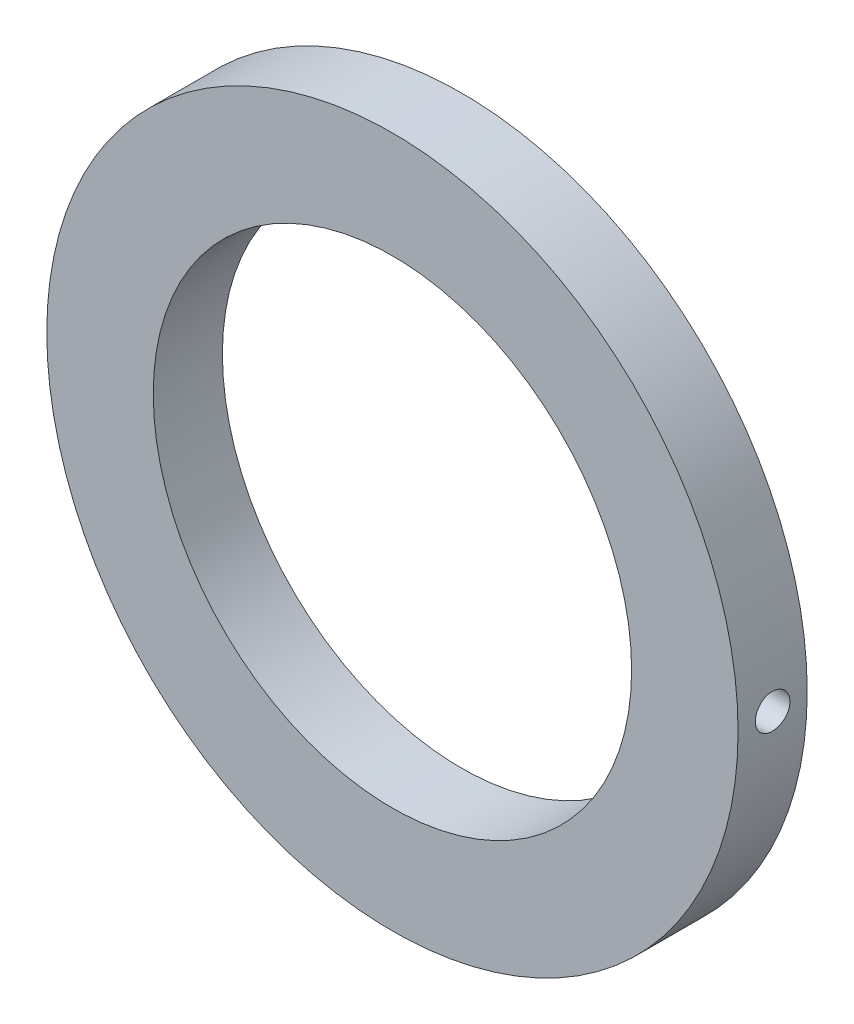
ISO-10303-21;
HEADER;
FILE_DESCRIPTION(('STEP AP214'),'2;1');
FILE_NAME('part.step','',(''),(''),'','','');
FILE_SCHEMA(('AUTOMOTIVE_DESIGN { 1 0 10303 214 1 1 1 1 }'));
ENDSEC;
DATA;
#1=APPLICATION_CONTEXT('core data for automotive mechanical design processes');
#2=APPLICATION_PROTOCOL_DEFINITION('international standard','automotive_design',2000,#1);
#3=PRODUCT_CONTEXT('',#1,'mechanical');
#4=PRODUCT('Part','Part','',(#3));
#5=PRODUCT_RELATED_PRODUCT_CATEGORY('part','',(#4));
#6=PRODUCT_DEFINITION_FORMATION('','',#4);
#7=PRODUCT_DEFINITION_CONTEXT('part definition',#1,'design');
#8=PRODUCT_DEFINITION('design','',#6,#7);
#9=PRODUCT_DEFINITION_SHAPE('','',#8);
#10=(LENGTH_UNIT() NAMED_UNIT(*) SI_UNIT(.MILLI.,.METRE.));
#11=(NAMED_UNIT(*) PLANE_ANGLE_UNIT() SI_UNIT($,.RADIAN.));
#12=(NAMED_UNIT(*) SI_UNIT($,.STERADIAN.) SOLID_ANGLE_UNIT());
#13=UNCERTAINTY_MEASURE_WITH_UNIT(LENGTH_MEASURE(1.E-05),#10,'distance_accuracy_value','');
#14=(GEOMETRIC_REPRESENTATION_CONTEXT(3) GLOBAL_UNCERTAINTY_ASSIGNED_CONTEXT((#13)) GLOBAL_UNIT_ASSIGNED_CONTEXT((#10,
#11,#12)) REPRESENTATION_CONTEXT('',''));
#15=CARTESIAN_POINT('',(0.,0.,0.));
#16=DIRECTION('',(0.,0.,1.));
#17=DIRECTION('',(1.,0.,0.));
#18=AXIS2_PLACEMENT_3D('',#15,#16,#17);
#19=CARTESIAN_POINT('',(0.,0.,5.));
#20=DIRECTION('',(0.,0.,1.));
#21=DIRECTION('',(1.,0.,0.));
#22=AXIS2_PLACEMENT_3D('',#19,#20,#21);
#23=PLANE('',#22);
#24=CARTESIAN_POINT('',(0.,0.,5.));
#25=DIRECTION('',(0.,0.,1.));
#26=DIRECTION('',(1.,0.,0.));
#27=AXIS2_PLACEMENT_3D('',#24,#25,#26);
#28=CIRCLE('',#27,25.);
#29=CARTESIAN_POINT('',(25.,0.,5.));
#30=VERTEX_POINT('',#29);
#31=EDGE_CURVE('E44',#30,#30,#28,.T.);
#32=ORIENTED_EDGE('',*,*,#31,.T.);
#33=EDGE_LOOP('',(#32));
#34=FACE_BOUND('',#33,.T.);
#35=CARTESIAN_POINT('',(0.,0.,5.));
#36=DIRECTION('',(0.,0.,1.));
#37=DIRECTION('',(1.,0.,0.));
#38=AXIS2_PLACEMENT_3D('',#35,#36,#37);
#39=CIRCLE('',#38,17.3);
#40=CARTESIAN_POINT('',(17.3,0.,5.));
#41=VERTEX_POINT('',#40);
#42=EDGE_CURVE('E53',#41,#41,#39,.T.);
#43=ORIENTED_EDGE('',*,*,#42,.F.);
#44=EDGE_LOOP('',(#43));
#45=FACE_BOUND('',#44,.T.);
#46=ADVANCED_FACE('F33',(#34,#45),#23,.T.);
#47=CARTESIAN_POINT('',(0.,0.,0.));
#48=DIRECTION('',(0.,0.,1.));
#49=DIRECTION('',(1.,0.,0.));
#50=AXIS2_PLACEMENT_3D('',#47,#48,#49);
#51=PLANE('',#50);
#52=CARTESIAN_POINT('',(0.,0.,0.));
#53=DIRECTION('',(0.,0.,1.));
#54=DIRECTION('',(1.,0.,0.));
#55=AXIS2_PLACEMENT_3D('',#52,#53,#54);
#56=CIRCLE('',#55,25.);
#57=CARTESIAN_POINT('',(25.,0.,0.));
#58=VERTEX_POINT('',#57);
#59=EDGE_CURVE('E48',#58,#58,#56,.T.);
#60=ORIENTED_EDGE('',*,*,#59,.F.);
#61=EDGE_LOOP('',(#60));
#62=FACE_BOUND('',#61,.T.);
#63=CARTESIAN_POINT('',(0.,0.,0.));
#64=DIRECTION('',(0.,0.,1.));
#65=DIRECTION('',(1.,0.,0.));
#66=AXIS2_PLACEMENT_3D('',#63,#64,#65);
#67=CIRCLE('',#66,17.3);
#68=CARTESIAN_POINT('',(17.3,0.,0.));
#69=VERTEX_POINT('',#68);
#70=EDGE_CURVE('E55',#69,#69,#67,.T.);
#71=ORIENTED_EDGE('',*,*,#70,.T.);
#72=EDGE_LOOP('',(#71));
#73=FACE_BOUND('',#72,.T.);
#74=ADVANCED_FACE('F79',(#62,#73),#51,.F.);
#75=CARTESIAN_POINT('',(0.,0.,5.));
#76=DIRECTION('',(0.,0.,-1.));
#77=DIRECTION('',(-1.,0.,0.));
#78=AXIS2_PLACEMENT_3D('',#75,#76,#77);
#79=CYLINDRICAL_SURFACE('',#78,25.);
#80=CARTESIAN_POINT('',(25.,0.,3.75));
#81=CARTESIAN_POINT('',(24.9999995819117,0.0701660105694059,3.74999690336634));
#82=CARTESIAN_POINT('',(24.9997014401605,0.140381780708363,3.74407223478051));
#83=CARTESIAN_POINT('',(24.9985407557502,0.27887631685631,3.72052157899107));
#84=CARTESIAN_POINT('',(24.9976775481142,0.347152701673982,3.70288180494293));
#85=CARTESIAN_POINT('',(24.995484432555,0.479742197971248,3.65640724653358));
#86=CARTESIAN_POINT('',(24.9941547625094,0.544057309930934,3.62757816748819));
#87=CARTESIAN_POINT('',(24.9911784751378,0.666917965989873,3.55955211692103));
#88=CARTESIAN_POINT('',(24.9895319326559,0.725464867593273,3.52035759286564));
#89=CARTESIAN_POINT('',(24.9861052669421,0.835203741091142,3.43266915995307));
#90=CARTESIAN_POINT('',(24.9843250269482,0.886389167570768,3.38416706366098));
#91=CARTESIAN_POINT('',(24.9808326169399,0.979896348600998,3.27925662624587));
#92=CARTESIAN_POINT('',(24.9791204497084,1.02221774107156,3.22284796231065));
#93=CARTESIAN_POINT('',(24.9759564334186,1.09681354861824,3.1036912924815));
#94=CARTESIAN_POINT('',(24.974504716945,1.12908285270626,3.04094008312359));
#95=CARTESIAN_POINT('',(24.9720267305806,1.18262568581016,2.91090214800052));
#96=CARTESIAN_POINT('',(24.9710004574612,1.20389929826922,2.84361545665822));
#97=CARTESIAN_POINT('',(24.9694901435453,1.23482957690258,2.70647678736551));
#98=CARTESIAN_POINT('',(24.969005645691,1.24449603572775,2.63662702316531));
#99=CARTESIAN_POINT('',(24.9686321458382,1.25196782546033,2.49629471991242));
#100=CARTESIAN_POINT('',(24.9687431391403,1.24977324997015,2.42581218585767));
#101=CARTESIAN_POINT('',(24.9695476802324,1.23359342501536,2.28628164637598));
#102=CARTESIAN_POINT('',(24.9702407052381,1.21961875645744,2.21723241056543));
#103=CARTESIAN_POINT('',(24.9721303755955,1.18029183172995,2.08246110745228));
#104=CARTESIAN_POINT('',(24.9733270230754,1.15493952748297,2.01673905421034));
#105=CARTESIAN_POINT('',(24.9760896682581,1.09356490690355,1.89045363908859));
#106=CARTESIAN_POINT('',(24.9776558328788,1.05753776665821,1.82989262542622));
#107=CARTESIAN_POINT('',(24.9809808200124,0.975839667344602,1.71567407913215));
#108=CARTESIAN_POINT('',(24.9827396438849,0.930168640217463,1.66201659522438));
#109=CARTESIAN_POINT('',(24.9862540364547,0.830419489942966,1.56306666257013));
#110=CARTESIAN_POINT('',(24.9880095994686,0.776332203982183,1.51778344992735));
#111=CARTESIAN_POINT('',(24.9913177436274,0.661318078271939,1.43693865552272));
#112=CARTESIAN_POINT('',(24.9928703247224,0.600391236840118,1.40137707615216));
#113=CARTESIAN_POINT('',(24.995597594826,0.473422087721171,1.34098589722109));
#114=CARTESIAN_POINT('',(24.9967722724862,0.407379626485863,1.31615661994393));
#115=CARTESIAN_POINT('',(24.9986111820891,0.272056338561529,1.27794089462543));
#116=CARTESIAN_POINT('',(24.9992754178531,0.202775536119672,1.26455436092072));
#117=CARTESIAN_POINT('',(25.0000180919379,0.0630223759012306,1.24961550093928));
#118=CARTESIAN_POINT('',(25.0000971626323,-0.0074486130683485,1.24805039949133));
#119=CARTESIAN_POINT('',(24.9996622741137,-0.147652217208958,1.25676549258248));
#120=CARTESIAN_POINT('',(24.9991483168621,-0.217384834821243,1.26704564794561));
#121=CARTESIAN_POINT('',(24.9975856679328,-0.354096444015759,1.29914886493429));
#122=CARTESIAN_POINT('',(24.9965372464886,-0.421076808704313,1.32096609344111));
#123=CARTESIAN_POINT('',(24.9940237072191,-0.55042488187272,1.37551823150765));
#124=CARTESIAN_POINT('',(24.9925585869952,-0.612792563798187,1.40825320391288));
#125=CARTESIAN_POINT('',(24.9893748938646,-0.73120353987069,1.48374431104523));
#126=CARTESIAN_POINT('',(24.9876561048368,-0.787241368513506,1.52650900939837));
#127=CARTESIAN_POINT('',(24.9841593632411,-0.891346975210282,1.6208331235589));
#128=CARTESIAN_POINT('',(24.9823814102936,-0.939414702128808,1.67239259578844));
#129=CARTESIAN_POINT('',(24.9789649315915,-1.0262586476335,1.78289763024195));
#130=CARTESIAN_POINT('',(24.9773265306989,-1.06502660055206,1.84184969268992));
#131=CARTESIAN_POINT('',(24.9743758735381,-1.13211402404492,1.96543362856948));
#132=CARTESIAN_POINT('',(24.9730636158504,-1.16043354009176,2.0300654772806));
#133=CARTESIAN_POINT('',(24.970914113439,-1.20580579118823,2.1631437021136));
#134=CARTESIAN_POINT('',(24.9700766465809,-1.22286379563346,2.23158827793448));
#135=CARTESIAN_POINT('',(24.9689705392419,-1.24524604392568,2.37037426167751));
#136=CARTESIAN_POINT('',(24.9687018955315,-1.25057035438998,2.44071565882828));
#137=CARTESIAN_POINT('',(24.9687638091282,-1.24933344302314,2.58121626970424));
#138=CARTESIAN_POINT('',(24.9690937108768,-1.24278522461275,2.65137559856768));
#139=CARTESIAN_POINT('',(24.9703141477253,-1.21801601458775,2.78959748581421));
#140=CARTESIAN_POINT('',(24.9712046838937,-1.19979500072664,2.85766004020093));
#141=CARTESIAN_POINT('',(24.97344587178,-1.1522000825143,2.98975905824547));
#142=CARTESIAN_POINT('',(24.9747965268747,-1.12282609631376,3.05379549235241));
#143=CARTESIAN_POINT('',(24.9778056807892,-1.05376129945733,3.17602860424686));
#144=CARTESIAN_POINT('',(24.9794641701633,-1.01407080534736,3.23422546113673));
#145=CARTESIAN_POINT('',(24.9829041383335,-0.925453104565613,3.34319236814328));
#146=CARTESIAN_POINT('',(24.9846857367194,-0.876516834092045,3.3939550429751));
#147=CARTESIAN_POINT('',(24.9881702804716,-0.77080264987275,3.48656044955993));
#148=CARTESIAN_POINT('',(24.9898732063806,-0.714022809956491,3.52840098383462));
#149=CARTESIAN_POINT('',(24.9930096903911,-0.594188689136985,3.60199397538918));
#150=CARTESIAN_POINT('',(24.9944429888302,-0.53112844841097,3.63373672821136));
#151=CARTESIAN_POINT('',(24.9968748255196,-0.400613590673067,3.68614619817691));
#152=CARTESIAN_POINT('',(24.9978738770252,-0.333164270361613,3.70682599781874));
#153=CARTESIAN_POINT('',(24.9990604002574,-0.221079907522765,3.73109818562432));
#154=CARTESIAN_POINT('',(24.9994112016638,-0.17717085351058,3.73817731655168));
#155=CARTESIAN_POINT('',(24.9998811338173,-0.0888478510487014,3.74762920223142));
#156=CARTESIAN_POINT('',(25.000000264762,-0.0444339030298512,3.75000196099961));
#157=CARTESIAN_POINT('',(25.,0.,3.75));
#158=B_SPLINE_CURVE_WITH_KNOTS('',3,(#80,#81,#82,#83,#84,#85,#86,#87,#88,#89,#90,#91,#92,#93,
#94,#95,#96,#97,#98,#99,#100,#101,#102,#103,#104,#105,#106,#107,#108,#109,#110,#111,#112,#113,
#114,#115,#116,#117,#118,#119,#120,#121,#122,#123,#124,#125,#126,#127,#128,#129,#130,#131,#132,
#133,#134,#135,#136,#137,#138,#139,#140,#141,#142,#143,#144,#145,#146,#147,#148,#149,#150,#151,
#152,#153,#154,#155,#156,#157),.UNSPECIFIED.,.T.,.F.,(4,2,2,2,2,2,2,2,2,2,2,2,2,2,2,2,2,2,2,2,2,
2,2,2,2,2,2,2,2,2,2,2,2,2,2,2,2,2,4),(0.,0.210335831380307,0.420919634765643,0.631396204317746,
0.841823120901405,1.0524359957767,1.2630574721365,1.47378586492448,1.68451265853095,
1.89506154227701,2.10560876446025,2.31596707390349,2.52632627224663,2.73678067637285,
2.94723656576845,3.15792320341372,3.36860989288274,3.57930290868261,3.78999434716531,
4.00045806325537,4.21092108327797,4.42127779525866,4.63163571813082,4.84217390786523,
5.05271344834089,5.26343942936163,5.47416449327316,5.68479088639797,5.89541608370188,
6.10581073250256,6.31620578228342,6.52660237613921,6.7369925150661,6.94758998358237,
7.1582392614388,7.36909037611058,7.57969159444961,7.71289070088451,7.84608969366479),.UNSPECIFIED.);
#159=CARTESIAN_POINT('',(25.,0.,3.75));
#160=VERTEX_POINT('',#159);
#161=EDGE_CURVE('E10',#160,#160,#158,.T.);
#162=ORIENTED_EDGE('',*,*,#161,.T.);
#163=EDGE_LOOP('',(#162));
#164=FACE_BOUND('',#163,.T.);
#165=ORIENTED_EDGE('',*,*,#31,.F.);
#166=EDGE_LOOP('',(#165));
#167=FACE_BOUND('',#166,.T.);
#168=ORIENTED_EDGE('',*,*,#59,.T.);
#169=EDGE_LOOP('',(#168));
#170=FACE_BOUND('',#169,.T.);
#171=ADVANCED_FACE('F35',(#164,#167,#170),#79,.T.);
#172=CARTESIAN_POINT('',(0.,0.,5.));
#173=DIRECTION('',(0.,0.,-1.));
#174=DIRECTION('',(-1.,0.,0.));
#175=AXIS2_PLACEMENT_3D('',#172,#173,#174);
#176=CYLINDRICAL_SURFACE('',#175,17.3);
#177=CARTESIAN_POINT('',(17.3,0.,3.75));
#178=CARTESIAN_POINT('',(17.2999994033657,0.070114923861524,3.74999692431212));
#179=CARTESIAN_POINT('',(17.2995691960644,0.140278352643099,3.74408084461307));
#180=CARTESIAN_POINT('',(17.2978943748129,0.27866614715968,3.72056629535962));
#181=CARTESIAN_POINT('',(17.2966488239013,0.346888187695396,3.70295438507267));
#182=CARTESIAN_POINT('',(17.2934841549664,0.479368736495633,3.65655817029235));
#183=CARTESIAN_POINT('',(17.2915654035038,0.543629379417037,3.62777994500862));
#184=CARTESIAN_POINT('',(17.2872698671257,0.666391828804038,3.55987831795164));
#185=CARTESIAN_POINT('',(17.2848931841372,0.7248949124249,3.52075721758907));
#186=CARTESIAN_POINT('',(17.2799435465405,0.834611999742316,3.43319728663906));
#187=CARTESIAN_POINT('',(17.2773702599774,0.885813237423322,3.38474247698171));
#188=CARTESIAN_POINT('',(17.2723202512997,0.979363853676874,3.279923981758));
#189=CARTESIAN_POINT('',(17.2698435333115,1.02171285432615,3.22355995869993));
#190=CARTESIAN_POINT('',(17.2652633174443,1.09639829012145,3.1044480176629));
#191=CARTESIAN_POINT('',(17.2631602281882,1.12872379139973,3.04169322688233));
#192=CARTESIAN_POINT('',(17.2595688587821,1.18237473386134,2.91162917741764));
#193=CARTESIAN_POINT('',(17.2580805701896,1.20370032609692,2.84431998128959));
#194=CARTESIAN_POINT('',(17.25588987722,1.23470980080796,2.70718348052171));
#195=CARTESIAN_POINT('',(17.2551860932855,1.24441412161859,2.63736081981899));
#196=CARTESIAN_POINT('',(17.254639649904,1.25196869825686,2.49707435650879));
#197=CARTESIAN_POINT('',(17.2547969779351,1.24981912645884,2.42661056323927));
#198=CARTESIAN_POINT('',(17.2559537366732,1.23374386251109,2.28718165070702));
#199=CARTESIAN_POINT('',(17.256951582929,1.21984032744321,2.21821396189793));
#200=CARTESIAN_POINT('',(17.2596744457087,1.18068619943776,2.0835938054452));
#201=CARTESIAN_POINT('',(17.261399467782,1.15543551990286,2.01794136310659));
#202=CARTESIAN_POINT('',(17.2653841233069,1.09427887221161,1.89174438935981));
#203=CARTESIAN_POINT('',(17.2676442582572,1.05836290064536,1.83120472220682));
#204=CARTESIAN_POINT('',(17.2724439737033,0.976902421812837,1.71700498053812));
#205=CARTESIAN_POINT('',(17.2749835584312,0.931357768715209,1.66334501023874));
#206=CARTESIAN_POINT('',(17.2800630445515,0.831808205167089,1.56429899448886));
#207=CARTESIAN_POINT('',(17.2826029333082,0.777784128182536,1.51893221013084));
#208=CARTESIAN_POINT('',(17.2873912451733,0.662876311369709,1.4379090838678));
#209=CARTESIAN_POINT('',(17.2896396681445,0.601992568308869,1.40225274653876));
#210=CARTESIAN_POINT('',(17.2935919788922,0.475081638389091,1.34166410932025));
#211=CARTESIAN_POINT('',(17.2952958269084,0.409054076407892,1.31673259242393));
#212=CARTESIAN_POINT('',(17.2979665049281,0.273735233292313,1.27831444367749));
#213=CARTESIAN_POINT('',(17.2989333464305,0.204444003096072,1.26482763326501));
#214=CARTESIAN_POINT('',(17.3000195918018,0.0647317902460638,1.24970572702184));
#215=CARTESIAN_POINT('',(17.3001408990164,-0.00568629710314193,1.248044012053));
#216=CARTESIAN_POINT('',(17.2995274788796,-0.145800136770446,1.25654983656543));
#217=CARTESIAN_POINT('',(17.2987927575067,-0.21549589412971,1.26671729343432));
#218=CARTESIAN_POINT('',(17.2965511790455,-0.352111286018929,1.29857079458316));
#219=CARTESIAN_POINT('',(17.2950451443399,-0.419033795436318,1.32024457159737));
#220=CARTESIAN_POINT('',(17.2914302620586,-0.548291880733669,1.37448298545236));
#221=CARTESIAN_POINT('',(17.2893214072653,-0.610627401682832,1.40704775269069));
#222=CARTESIAN_POINT('',(17.284732853619,-0.729063605681254,1.48221114042527));
#223=CARTESIAN_POINT('',(17.2822525028392,-0.785153019761441,1.52482747722346));
#224=CARTESIAN_POINT('',(17.2772020856568,-0.889391261196724,1.61885858081699));
#225=CARTESIAN_POINT('',(17.2746320180808,-0.937539984643938,1.67027346272772));
#226=CARTESIAN_POINT('',(17.2696862599813,-1.02462074576514,1.78055731325772));
#227=CARTESIAN_POINT('',(17.2673109399711,-1.06353547011276,1.83943997147536));
#228=CARTESIAN_POINT('',(17.2630285179149,-1.13092503962443,1.96291940162287));
#229=CARTESIAN_POINT('',(17.2611214122,-1.15939996659352,2.02751612877304));
#230=CARTESIAN_POINT('',(17.2579931900193,-1.20507187129617,2.160527633198));
#231=CARTESIAN_POINT('',(17.2567714187791,-1.22227961643235,2.22893869726802));
#232=CARTESIAN_POINT('',(17.2551498530509,-1.24496381204958,2.36768819428632));
#233=CARTESIAN_POINT('',(17.2547500471192,-1.250440425854,2.43802660038792));
#234=CARTESIAN_POINT('',(17.2548177834237,-1.24950520359415,2.57846204042749));
#235=CARTESIAN_POINT('',(17.2552833404572,-1.24312057805331,2.64855925814592));
#236=CARTESIAN_POINT('',(17.257025132703,-1.2187006706166,2.7866833633854));
#237=CARTESIAN_POINT('',(17.2583013692949,-1.20066536889474,2.85471024738315));
#238=CARTESIAN_POINT('',(17.2615202079127,-1.15346255412812,2.98676567148846));
#239=CARTESIAN_POINT('',(17.2634627925564,-1.12429533146706,3.05079431584212));
#240=CARTESIAN_POINT('',(17.2677954364939,-1.05565997239775,3.17304998518309));
#241=CARTESIAN_POINT('',(17.2701854861817,-1.01619205711307,3.23127713467324));
#242=CARTESIAN_POINT('',(17.2751502105663,-0.927973981158281,3.34041572325137));
#243=CARTESIAN_POINT('',(17.2777252745824,-0.879203867124294,3.39131101576846));
#244=CARTESIAN_POINT('',(17.282766397839,-0.773798055947071,3.48421148269716));
#245=CARTESIAN_POINT('',(17.2852324303878,-0.717160446695189,3.5262144896533));
#246=CARTESIAN_POINT('',(17.2897809859696,-0.597543801195182,3.600179819472));
#247=CARTESIAN_POINT('',(17.2918629267428,-0.534555357401472,3.63212694917462));
#248=CARTESIAN_POINT('',(17.2954014156802,-0.404138069298673,3.68495195965718));
#249=CARTESIAN_POINT('',(17.2968586900531,-0.336714486887438,3.70584270076233));
#250=CARTESIAN_POINT('',(17.2986051189727,-0.224070550108006,3.7305793627639));
#251=CARTESIAN_POINT('',(17.2991258502868,-0.179576793283255,3.73785257159702));
#252=CARTESIAN_POINT('',(17.2998234821075,-0.0900620290294369,3.74756387348856));
#253=CARTESIAN_POINT('',(17.3000003832711,-0.0450410226080827,3.7500019757866));
#254=CARTESIAN_POINT('',(17.3,0.,3.75));
#255=B_SPLINE_CURVE_WITH_KNOTS('',3,(#177,#178,#179,#180,#181,#182,#183,#184,#185,#186,#187,
#188,#189,#190,#191,#192,#193,#194,#195,#196,#197,#198,#199,#200,#201,#202,#203,#204,#205,#206,
#207,#208,#209,#210,#211,#212,#213,#214,#215,#216,#217,#218,#219,#220,#221,#222,#223,#224,#225,
#226,#227,#228,#229,#230,#231,#232,#233,#234,#235,#236,#237,#238,#239,#240,#241,#242,#243,#244,
#245,#246,#247,#248,#249,#250,#251,#252,#253,#254),.UNSPECIFIED.,.T.,.F.,(4,2,2,2,2,2,2,2,2,2,2,
2,2,2,2,2,2,2,2,2,2,2,2,2,2,2,2,2,2,2,2,2,2,2,2,2,2,2,4),(0.,0.210180335521117,
0.420602627144897,0.630910520203792,0.84117165662449,1.05179600629729,1.26242934619393,
1.47329164809093,1.68415105432107,1.89463907483528,2.10512403452886,2.31521309712773,
2.52530376307818,2.73559210735841,2.94588363679249,3.15665753369566,3.36743152992486,
3.57822091164234,3.78900700452579,3.99931845226169,4.20962843123674,4.4197146407917,
4.6298033657935,4.84026518493397,5.05072975785344,5.26158587810531,5.47244034607802,
5.68309301723325,5.89374275561692,6.10390984520343,6.31407729243266,6.52423925767613,
6.73439671177215,6.94501013238994,7.15567483014685,7.36665630461063,7.57739183195753,
7.71240952595325,7.84742696193703),.UNSPECIFIED.);
#256=CARTESIAN_POINT('',(17.3,0.,3.75));
#257=VERTEX_POINT('',#256);
#258=EDGE_CURVE('E58',#257,#257,#255,.T.);
#259=ORIENTED_EDGE('',*,*,#258,.F.);
#260=EDGE_LOOP('',(#259));
#261=FACE_BOUND('',#260,.T.);
#262=ORIENTED_EDGE('',*,*,#42,.T.);
#263=EDGE_LOOP('',(#262));
#264=FACE_BOUND('',#263,.T.);
#265=ORIENTED_EDGE('',*,*,#70,.F.);
#266=EDGE_LOOP('',(#265));
#267=FACE_BOUND('',#266,.T.);
#268=ADVANCED_FACE('F65',(#261,#264,#267),#176,.F.);
#269=CARTESIAN_POINT('',(0.,0.,2.5));
#270=DIRECTION('',(-1.,0.,0.));
#271=DIRECTION('',(0.,0.,1.));
#272=AXIS2_PLACEMENT_3D('',#269,#270,#271);
#273=CYLINDRICAL_SURFACE('',#272,1.25);
#274=ORIENTED_EDGE('',*,*,#258,.T.);
#275=EDGE_LOOP('',(#274));
#276=FACE_BOUND('',#275,.T.);
#277=ORIENTED_EDGE('',*,*,#161,.F.);
#278=EDGE_LOOP('',(#277));
#279=FACE_BOUND('',#278,.T.);
#280=ADVANCED_FACE('F68',(#276,#279),#273,.F.);
#281=CLOSED_SHELL('',(#46,#74,#171,#268,#280));
#282=MANIFOLD_SOLID_BREP('B2',#281);
#283=ADVANCED_BREP_SHAPE_REPRESENTATION('',(#18,#282),#14);
#284=SHAPE_DEFINITION_REPRESENTATION(#9,#283);
ENDSEC;
END-ISO-10303-21;
